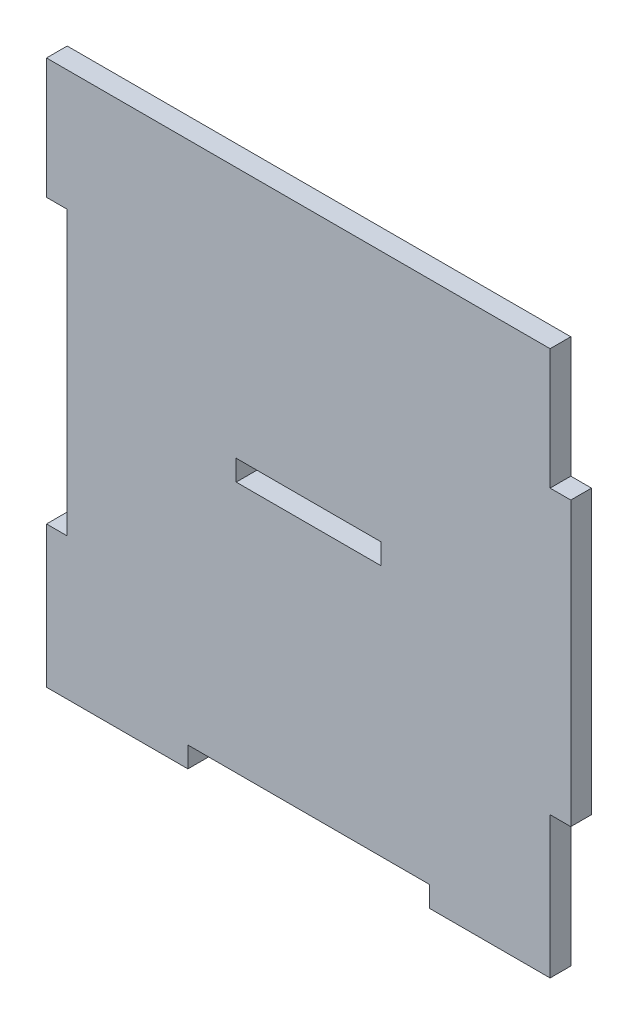
ISO-10303-21;
HEADER;
FILE_DESCRIPTION(('STEP AP214'),'2;1');
FILE_NAME('part.step','',(''),(''),'','','');
FILE_SCHEMA(('AUTOMOTIVE_DESIGN { 1 0 10303 214 1 1 1 1 }'));
ENDSEC;
DATA;
#1=APPLICATION_CONTEXT('core data for automotive mechanical design processes');
#2=APPLICATION_PROTOCOL_DEFINITION('international standard','automotive_design',2000,#1);
#3=PRODUCT_CONTEXT('',#1,'mechanical');
#4=PRODUCT('Part','Part','',(#3));
#5=PRODUCT_RELATED_PRODUCT_CATEGORY('part','',(#4));
#6=PRODUCT_DEFINITION_FORMATION('','',#4);
#7=PRODUCT_DEFINITION_CONTEXT('part definition',#1,'design');
#8=PRODUCT_DEFINITION('design','',#6,#7);
#9=PRODUCT_DEFINITION_SHAPE('','',#8);
#10=(LENGTH_UNIT() NAMED_UNIT(*) SI_UNIT(.MILLI.,.METRE.));
#11=(NAMED_UNIT(*) PLANE_ANGLE_UNIT() SI_UNIT($,.RADIAN.));
#12=(NAMED_UNIT(*) SI_UNIT($,.STERADIAN.) SOLID_ANGLE_UNIT());
#13=UNCERTAINTY_MEASURE_WITH_UNIT(LENGTH_MEASURE(1.E-05),#10,'distance_accuracy_value','');
#14=(GEOMETRIC_REPRESENTATION_CONTEXT(3) GLOBAL_UNCERTAINTY_ASSIGNED_CONTEXT((#13)) GLOBAL_UNIT_ASSIGNED_CONTEXT((#10,
#11,#12)) REPRESENTATION_CONTEXT('',''));
#15=CARTESIAN_POINT('',(0.,0.,0.));
#16=DIRECTION('',(0.,0.,1.));
#17=DIRECTION('',(1.,0.,0.));
#18=AXIS2_PLACEMENT_3D('',#15,#16,#17);
#19=CARTESIAN_POINT('',(35.,-20.5,3.));
#20=DIRECTION('',(0.,1.,0.));
#21=DIRECTION('',(-1.,0.,0.));
#22=AXIS2_PLACEMENT_3D('',#19,#20,#21);
#23=PLANE('',#22);
#24=DIRECTION('',(1.,0.,0.));
#25=VECTOR('',#24,1.);
#26=CARTESIAN_POINT('',(35.,-20.5,0.));
#27=LINE('',#26,#25);
#28=CARTESIAN_POINT('',(35.,-20.5,0.));
#29=VERTEX_POINT('',#28);
#30=CARTESIAN_POINT('',(38.,-20.5,0.));
#31=VERTEX_POINT('',#30);
#32=EDGE_CURVE('E218',#29,#31,#27,.T.);
#33=ORIENTED_EDGE('',*,*,#32,.T.);
#34=DIRECTION('',(0.,0.,-1.));
#35=VECTOR('',#34,1.);
#36=CARTESIAN_POINT('',(38.,-20.5,3.));
#37=LINE('',#36,#35);
#38=CARTESIAN_POINT('',(38.,-20.5,3.));
#39=VERTEX_POINT('',#38);
#40=EDGE_CURVE('E46',#39,#31,#37,.T.);
#41=ORIENTED_EDGE('',*,*,#40,.F.);
#42=DIRECTION('',(1.,0.,0.));
#43=VECTOR('',#42,1.);
#44=CARTESIAN_POINT('',(35.,-20.5,3.));
#45=LINE('',#44,#43);
#46=CARTESIAN_POINT('',(35.,-20.5,3.));
#47=VERTEX_POINT('',#46);
#48=EDGE_CURVE('E228',#47,#39,#45,.T.);
#49=ORIENTED_EDGE('',*,*,#48,.F.);
#50=DIRECTION('',(0.,0.,-1.));
#51=VECTOR('',#50,1.);
#52=CARTESIAN_POINT('',(35.,-20.5,3.));
#53=LINE('',#52,#51);
#54=EDGE_CURVE('E11',#47,#29,#53,.T.);
#55=ORIENTED_EDGE('',*,*,#54,.T.);
#56=EDGE_LOOP('',(#33,#41,#49,#55));
#57=FACE_BOUND('',#56,.T.);
#58=ADVANCED_FACE('F38',(#57),#23,.F.);
#59=CARTESIAN_POINT('',(38.,20.5,3.));
#60=DIRECTION('',(-1.,0.,0.));
#61=DIRECTION('',(0.,0.,1.));
#62=AXIS2_PLACEMENT_3D('',#59,#60,#61);
#63=PLANE('',#62);
#64=DIRECTION('',(0.,1.,0.));
#65=VECTOR('',#64,1.);
#66=CARTESIAN_POINT('',(38.,20.5,0.));
#67=LINE('',#66,#65);
#68=CARTESIAN_POINT('',(38.,20.5,0.));
#69=VERTEX_POINT('',#68);
#70=EDGE_CURVE('E278',#31,#69,#67,.T.);
#71=ORIENTED_EDGE('',*,*,#70,.T.);
#72=DIRECTION('',(0.,0.,-1.));
#73=VECTOR('',#72,1.);
#74=CARTESIAN_POINT('',(38.,20.5,3.));
#75=LINE('',#74,#73);
#76=CARTESIAN_POINT('',(38.,20.5,3.));
#77=VERTEX_POINT('',#76);
#78=EDGE_CURVE('E376',#77,#69,#75,.T.);
#79=ORIENTED_EDGE('',*,*,#78,.F.);
#80=DIRECTION('',(0.,1.,0.));
#81=VECTOR('',#80,1.);
#82=CARTESIAN_POINT('',(38.,20.5,3.));
#83=LINE('',#82,#81);
#84=EDGE_CURVE('E232',#39,#77,#83,.T.);
#85=ORIENTED_EDGE('',*,*,#84,.F.);
#86=ORIENTED_EDGE('',*,*,#40,.T.);
#87=EDGE_LOOP('',(#71,#79,#85,#86));
#88=FACE_BOUND('',#87,.T.);
#89=ADVANCED_FACE('F385',(#88),#63,.F.);
#90=CARTESIAN_POINT('',(35.,20.5,3.));
#91=DIRECTION('',(0.,-1.,0.));
#92=DIRECTION('',(1.,0.,0.));
#93=AXIS2_PLACEMENT_3D('',#90,#91,#92);
#94=PLANE('',#93);
#95=DIRECTION('',(-1.,0.,0.));
#96=VECTOR('',#95,1.);
#97=CARTESIAN_POINT('',(35.,20.5,0.));
#98=LINE('',#97,#96);
#99=CARTESIAN_POINT('',(35.,20.5,0.));
#100=VERTEX_POINT('',#99);
#101=EDGE_CURVE('E281',#69,#100,#98,.T.);
#102=ORIENTED_EDGE('',*,*,#101,.T.);
#103=DIRECTION('',(0.,0.,-1.));
#104=VECTOR('',#103,1.);
#105=CARTESIAN_POINT('',(35.,20.5,3.));
#106=LINE('',#105,#104);
#107=CARTESIAN_POINT('',(35.,20.5,3.));
#108=VERTEX_POINT('',#107);
#109=EDGE_CURVE('E372',#108,#100,#106,.T.);
#110=ORIENTED_EDGE('',*,*,#109,.F.);
#111=DIRECTION('',(-1.,0.,0.));
#112=VECTOR('',#111,1.);
#113=CARTESIAN_POINT('',(35.,20.5,3.));
#114=LINE('',#113,#112);
#115=EDGE_CURVE('E235',#77,#108,#114,.T.);
#116=ORIENTED_EDGE('',*,*,#115,.F.);
#117=ORIENTED_EDGE('',*,*,#78,.T.);
#118=EDGE_LOOP('',(#102,#110,#116,#117));
#119=FACE_BOUND('',#118,.T.);
#120=ADVANCED_FACE('F394',(#119),#94,.F.);
#121=CARTESIAN_POINT('',(35.,38.,3.));
#122=DIRECTION('',(-1.,0.,0.));
#123=DIRECTION('',(0.,-1.,0.));
#124=AXIS2_PLACEMENT_3D('',#121,#122,#123);
#125=PLANE('',#124);
#126=DIRECTION('',(0.,1.,0.));
#127=VECTOR('',#126,1.);
#128=CARTESIAN_POINT('',(35.,38.,0.));
#129=LINE('',#128,#127);
#130=CARTESIAN_POINT('',(35.,38.,0.));
#131=VERTEX_POINT('',#130);
#132=EDGE_CURVE('E284',#100,#131,#129,.T.);
#133=ORIENTED_EDGE('',*,*,#132,.T.);
#134=DIRECTION('',(0.,0.,-1.));
#135=VECTOR('',#134,1.);
#136=CARTESIAN_POINT('',(35.,38.,3.));
#137=LINE('',#136,#135);
#138=CARTESIAN_POINT('',(35.,38.,3.));
#139=VERTEX_POINT('',#138);
#140=EDGE_CURVE('E368',#139,#131,#137,.T.);
#141=ORIENTED_EDGE('',*,*,#140,.F.);
#142=DIRECTION('',(0.,1.,0.));
#143=VECTOR('',#142,1.);
#144=CARTESIAN_POINT('',(35.,38.,3.));
#145=LINE('',#144,#143);
#146=EDGE_CURVE('E238',#108,#139,#145,.T.);
#147=ORIENTED_EDGE('',*,*,#146,.F.);
#148=ORIENTED_EDGE('',*,*,#109,.T.);
#149=EDGE_LOOP('',(#133,#141,#147,#148));
#150=FACE_BOUND('',#149,.T.);
#151=ADVANCED_FACE('F398',(#150),#125,.F.);
#152=CARTESIAN_POINT('',(-38.,38.,3.));
#153=DIRECTION('',(0.,-1.,0.));
#154=DIRECTION('',(0.,0.,-1.));
#155=AXIS2_PLACEMENT_3D('',#152,#153,#154);
#156=PLANE('',#155);
#157=DIRECTION('',(-1.,0.,0.));
#158=VECTOR('',#157,1.);
#159=CARTESIAN_POINT('',(-38.,38.,0.));
#160=LINE('',#159,#158);
#161=CARTESIAN_POINT('',(-38.,38.,0.));
#162=VERTEX_POINT('',#161);
#163=EDGE_CURVE('E288',#131,#162,#160,.T.);
#164=ORIENTED_EDGE('',*,*,#163,.T.);
#165=DIRECTION('',(0.,0.,-1.));
#166=VECTOR('',#165,1.);
#167=CARTESIAN_POINT('',(-38.,38.,3.));
#168=LINE('',#167,#166);
#169=CARTESIAN_POINT('',(-38.,38.,3.));
#170=VERTEX_POINT('',#169);
#171=EDGE_CURVE('E364',#170,#162,#168,.T.);
#172=ORIENTED_EDGE('',*,*,#171,.F.);
#173=DIRECTION('',(-1.,0.,0.));
#174=VECTOR('',#173,1.);
#175=CARTESIAN_POINT('',(17.5,38.,3.));
#176=LINE('',#175,#174);
#177=EDGE_CURVE('E241',#139,#170,#176,.T.);
#178=ORIENTED_EDGE('',*,*,#177,.F.);
#179=ORIENTED_EDGE('',*,*,#140,.T.);
#180=EDGE_LOOP('',(#164,#172,#178,#179));
#181=FACE_BOUND('',#180,.T.);
#182=ADVANCED_FACE('F456',(#181),#156,.F.);
#183=CARTESIAN_POINT('',(-38.,20.5,3.));
#184=DIRECTION('',(1.,0.,0.));
#185=DIRECTION('',(0.,0.,-1.));
#186=AXIS2_PLACEMENT_3D('',#183,#184,#185);
#187=PLANE('',#186);
#188=DIRECTION('',(0.,-1.,0.));
#189=VECTOR('',#188,1.);
#190=CARTESIAN_POINT('',(-38.,20.5,0.));
#191=LINE('',#190,#189);
#192=CARTESIAN_POINT('',(-38.,20.5,0.));
#193=VERTEX_POINT('',#192);
#194=EDGE_CURVE('E291',#162,#193,#191,.T.);
#195=ORIENTED_EDGE('',*,*,#194,.T.);
#196=DIRECTION('',(0.,0.,-1.));
#197=VECTOR('',#196,1.);
#198=CARTESIAN_POINT('',(-38.,20.5,3.));
#199=LINE('',#198,#197);
#200=CARTESIAN_POINT('',(-38.,20.5,3.));
#201=VERTEX_POINT('',#200);
#202=EDGE_CURVE('E360',#201,#193,#199,.T.);
#203=ORIENTED_EDGE('',*,*,#202,.F.);
#204=DIRECTION('',(0.,-1.,0.));
#205=VECTOR('',#204,1.);
#206=CARTESIAN_POINT('',(-38.,20.5,3.));
#207=LINE('',#206,#205);
#208=EDGE_CURVE('E244',#170,#201,#207,.T.);
#209=ORIENTED_EDGE('',*,*,#208,.F.);
#210=ORIENTED_EDGE('',*,*,#171,.T.);
#211=EDGE_LOOP('',(#195,#203,#209,#210));
#212=FACE_BOUND('',#211,.T.);
#213=ADVANCED_FACE('F454',(#212),#187,.F.);
#214=CARTESIAN_POINT('',(-35.,20.5,3.));
#215=DIRECTION('',(0.,1.,0.));
#216=DIRECTION('',(0.,0.,1.));
#217=AXIS2_PLACEMENT_3D('',#214,#215,#216);
#218=PLANE('',#217);
#219=DIRECTION('',(1.,0.,0.));
#220=VECTOR('',#219,1.);
#221=CARTESIAN_POINT('',(-35.,20.5,0.));
#222=LINE('',#221,#220);
#223=CARTESIAN_POINT('',(-35.,20.5,0.));
#224=VERTEX_POINT('',#223);
#225=EDGE_CURVE('E294',#193,#224,#222,.T.);
#226=ORIENTED_EDGE('',*,*,#225,.T.);
#227=DIRECTION('',(0.,0.,-1.));
#228=VECTOR('',#227,1.);
#229=CARTESIAN_POINT('',(-35.,20.5,3.));
#230=LINE('',#229,#228);
#231=CARTESIAN_POINT('',(-35.,20.5,3.));
#232=VERTEX_POINT('',#231);
#233=EDGE_CURVE('E356',#232,#224,#230,.T.);
#234=ORIENTED_EDGE('',*,*,#233,.F.);
#235=DIRECTION('',(1.,0.,0.));
#236=VECTOR('',#235,1.);
#237=CARTESIAN_POINT('',(-35.,20.5,3.));
#238=LINE('',#237,#236);
#239=EDGE_CURVE('E247',#201,#232,#238,.T.);
#240=ORIENTED_EDGE('',*,*,#239,.F.);
#241=ORIENTED_EDGE('',*,*,#202,.T.);
#242=EDGE_LOOP('',(#226,#234,#240,#241));
#243=FACE_BOUND('',#242,.T.);
#244=ADVANCED_FACE('F449',(#243),#218,.F.);
#245=CARTESIAN_POINT('',(-35.,20.5,3.));
#246=DIRECTION('',(1.,0.,0.));
#247=DIRECTION('',(0.,0.,-1.));
#248=AXIS2_PLACEMENT_3D('',#245,#246,#247);
#249=PLANE('',#248);
#250=DIRECTION('',(0.,-1.,0.));
#251=VECTOR('',#250,1.);
#252=CARTESIAN_POINT('',(-35.,20.5,0.));
#253=LINE('',#252,#251);
#254=CARTESIAN_POINT('',(-35.,-20.5,0.));
#255=VERTEX_POINT('',#254);
#256=EDGE_CURVE('E297',#224,#255,#253,.T.);
#257=ORIENTED_EDGE('',*,*,#256,.T.);
#258=DIRECTION('',(0.,0.,-1.));
#259=VECTOR('',#258,1.);
#260=CARTESIAN_POINT('',(-35.,-20.5,3.));
#261=LINE('',#260,#259);
#262=CARTESIAN_POINT('',(-35.,-20.5,3.));
#263=VERTEX_POINT('',#262);
#264=EDGE_CURVE('E352',#263,#255,#261,.T.);
#265=ORIENTED_EDGE('',*,*,#264,.F.);
#266=DIRECTION('',(0.,-1.,0.));
#267=VECTOR('',#266,1.);
#268=CARTESIAN_POINT('',(-35.,20.5,3.));
#269=LINE('',#268,#267);
#270=EDGE_CURVE('E250',#232,#263,#269,.T.);
#271=ORIENTED_EDGE('',*,*,#270,.F.);
#272=ORIENTED_EDGE('',*,*,#233,.T.);
#273=EDGE_LOOP('',(#257,#265,#271,#272));
#274=FACE_BOUND('',#273,.T.);
#275=ADVANCED_FACE('F444',(#274),#249,.F.);
#276=CARTESIAN_POINT('',(-35.,-20.5,3.));
#277=DIRECTION('',(0.,-1.,0.));
#278=DIRECTION('',(0.,0.,-1.));
#279=AXIS2_PLACEMENT_3D('',#276,#277,#278);
#280=PLANE('',#279);
#281=DIRECTION('',(-1.,0.,0.));
#282=VECTOR('',#281,1.);
#283=CARTESIAN_POINT('',(-35.,-20.5,0.));
#284=LINE('',#283,#282);
#285=CARTESIAN_POINT('',(-38.,-20.5,0.));
#286=VERTEX_POINT('',#285);
#287=EDGE_CURVE('E300',#255,#286,#284,.T.);
#288=ORIENTED_EDGE('',*,*,#287,.T.);
#289=DIRECTION('',(0.,0.,-1.));
#290=VECTOR('',#289,1.);
#291=CARTESIAN_POINT('',(-38.,-20.5,3.));
#292=LINE('',#291,#290);
#293=CARTESIAN_POINT('',(-38.,-20.5,3.));
#294=VERTEX_POINT('',#293);
#295=EDGE_CURVE('E348',#294,#286,#292,.T.);
#296=ORIENTED_EDGE('',*,*,#295,.F.);
#297=DIRECTION('',(-1.,0.,0.));
#298=VECTOR('',#297,1.);
#299=CARTESIAN_POINT('',(-35.,-20.5,3.));
#300=LINE('',#299,#298);
#301=EDGE_CURVE('E253',#263,#294,#300,.T.);
#302=ORIENTED_EDGE('',*,*,#301,.F.);
#303=ORIENTED_EDGE('',*,*,#264,.T.);
#304=EDGE_LOOP('',(#288,#296,#302,#303));
#305=FACE_BOUND('',#304,.T.);
#306=ADVANCED_FACE('F439',(#305),#280,.F.);
#307=CARTESIAN_POINT('',(-38.,-38.,3.));
#308=DIRECTION('',(1.,0.,0.));
#309=DIRECTION('',(0.,0.,-1.));
#310=AXIS2_PLACEMENT_3D('',#307,#308,#309);
#311=PLANE('',#310);
#312=DIRECTION('',(0.,-1.,0.));
#313=VECTOR('',#312,1.);
#314=CARTESIAN_POINT('',(-38.,-38.,0.));
#315=LINE('',#314,#313);
#316=CARTESIAN_POINT('',(-38.,-41.,0.));
#317=VERTEX_POINT('',#316);
#318=EDGE_CURVE('E304',#286,#317,#315,.T.);
#319=ORIENTED_EDGE('',*,*,#318,.T.);
#320=DIRECTION('',(0.,0.,-1.));
#321=VECTOR('',#320,1.);
#322=CARTESIAN_POINT('',(-38.,-41.,3.));
#323=LINE('',#322,#321);
#324=CARTESIAN_POINT('',(-38.,-41.,3.));
#325=VERTEX_POINT('',#324);
#326=EDGE_CURVE('E344',#325,#317,#323,.T.);
#327=ORIENTED_EDGE('',*,*,#326,.F.);
#328=DIRECTION('',(0.,-1.,0.));
#329=VECTOR('',#328,1.);
#330=CARTESIAN_POINT('',(-38.,-20.5,3.));
#331=LINE('',#330,#329);
#332=EDGE_CURVE('E256',#294,#325,#331,.T.);
#333=ORIENTED_EDGE('',*,*,#332,.F.);
#334=ORIENTED_EDGE('',*,*,#295,.T.);
#335=EDGE_LOOP('',(#319,#327,#333,#334));
#336=FACE_BOUND('',#335,.T.);
#337=ADVANCED_FACE('F434',(#336),#311,.F.);
#338=CARTESIAN_POINT('',(-35.,-41.,3.));
#339=DIRECTION('',(0.,1.,0.));
#340=DIRECTION('',(0.,0.,1.));
#341=AXIS2_PLACEMENT_3D('',#338,#339,#340);
#342=PLANE('',#341);
#343=DIRECTION('',(1.,0.,0.));
#344=VECTOR('',#343,1.);
#345=CARTESIAN_POINT('',(-35.,-41.,0.));
#346=LINE('',#345,#344);
#347=CARTESIAN_POINT('',(-17.5,-41.,0.));
#348=VERTEX_POINT('',#347);
#349=EDGE_CURVE('E308',#317,#348,#346,.T.);
#350=ORIENTED_EDGE('',*,*,#349,.T.);
#351=DIRECTION('',(0.,0.,-1.));
#352=VECTOR('',#351,1.);
#353=CARTESIAN_POINT('',(-17.5,-41.,3.));
#354=LINE('',#353,#352);
#355=CARTESIAN_POINT('',(-17.5,-41.,3.));
#356=VERTEX_POINT('',#355);
#357=EDGE_CURVE('E340',#356,#348,#354,.T.);
#358=ORIENTED_EDGE('',*,*,#357,.F.);
#359=DIRECTION('',(1.,0.,0.));
#360=VECTOR('',#359,1.);
#361=CARTESIAN_POINT('',(-38.,-41.,3.));
#362=LINE('',#361,#360);
#363=EDGE_CURVE('E259',#325,#356,#362,.T.);
#364=ORIENTED_EDGE('',*,*,#363,.F.);
#365=ORIENTED_EDGE('',*,*,#326,.T.);
#366=EDGE_LOOP('',(#350,#358,#364,#365));
#367=FACE_BOUND('',#366,.T.);
#368=ADVANCED_FACE('F430',(#367),#342,.F.);
#369=CARTESIAN_POINT('',(-17.5,-38.,3.));
#370=DIRECTION('',(-1.,0.,0.));
#371=DIRECTION('',(0.,0.,1.));
#372=AXIS2_PLACEMENT_3D('',#369,#370,#371);
#373=PLANE('',#372);
#374=DIRECTION('',(0.,1.,0.));
#375=VECTOR('',#374,1.);
#376=CARTESIAN_POINT('',(-17.5,-38.,0.));
#377=LINE('',#376,#375);
#378=CARTESIAN_POINT('',(-17.5,-38.,0.));
#379=VERTEX_POINT('',#378);
#380=EDGE_CURVE('E311',#348,#379,#377,.T.);
#381=ORIENTED_EDGE('',*,*,#380,.T.);
#382=DIRECTION('',(0.,0.,-1.));
#383=VECTOR('',#382,1.);
#384=CARTESIAN_POINT('',(-17.5,-38.,3.));
#385=LINE('',#384,#383);
#386=CARTESIAN_POINT('',(-17.5,-38.,3.));
#387=VERTEX_POINT('',#386);
#388=EDGE_CURVE('E336',#387,#379,#385,.T.);
#389=ORIENTED_EDGE('',*,*,#388,.F.);
#390=DIRECTION('',(0.,1.,0.));
#391=VECTOR('',#390,1.);
#392=CARTESIAN_POINT('',(-17.5,-38.,3.));
#393=LINE('',#392,#391);
#394=EDGE_CURVE('E262',#356,#387,#393,.T.);
#395=ORIENTED_EDGE('',*,*,#394,.F.);
#396=ORIENTED_EDGE('',*,*,#357,.T.);
#397=EDGE_LOOP('',(#381,#389,#395,#396));
#398=FACE_BOUND('',#397,.T.);
#399=ADVANCED_FACE('F425',(#398),#373,.F.);
#400=CARTESIAN_POINT('',(-17.5,-38.,3.));
#401=DIRECTION('',(0.,1.,0.));
#402=DIRECTION('',(-1.,0.,0.));
#403=AXIS2_PLACEMENT_3D('',#400,#401,#402);
#404=PLANE('',#403);
#405=DIRECTION('',(1.,0.,0.));
#406=VECTOR('',#405,1.);
#407=CARTESIAN_POINT('',(-17.5,-38.,0.));
#408=LINE('',#407,#406);
#409=CARTESIAN_POINT('',(17.5,-38.,0.));
#410=VERTEX_POINT('',#409);
#411=EDGE_CURVE('E314',#379,#410,#408,.T.);
#412=ORIENTED_EDGE('',*,*,#411,.T.);
#413=DIRECTION('',(0.,0.,-1.));
#414=VECTOR('',#413,1.);
#415=CARTESIAN_POINT('',(17.5,-38.,3.));
#416=LINE('',#415,#414);
#417=CARTESIAN_POINT('',(17.5,-38.,3.));
#418=VERTEX_POINT('',#417);
#419=EDGE_CURVE('E332',#418,#410,#416,.T.);
#420=ORIENTED_EDGE('',*,*,#419,.F.);
#421=DIRECTION('',(1.,0.,0.));
#422=VECTOR('',#421,1.);
#423=CARTESIAN_POINT('',(-17.5,-38.,3.));
#424=LINE('',#423,#422);
#425=EDGE_CURVE('E265',#387,#418,#424,.T.);
#426=ORIENTED_EDGE('',*,*,#425,.F.);
#427=ORIENTED_EDGE('',*,*,#388,.T.);
#428=EDGE_LOOP('',(#412,#420,#426,#427));
#429=FACE_BOUND('',#428,.T.);
#430=ADVANCED_FACE('F421',(#429),#404,.F.);
#431=CARTESIAN_POINT('',(17.5,-41.,3.));
#432=DIRECTION('',(1.,0.,0.));
#433=DIRECTION('',(0.,1.,0.));
#434=AXIS2_PLACEMENT_3D('',#431,#432,#433);
#435=PLANE('',#434);
#436=DIRECTION('',(0.,-1.,0.));
#437=VECTOR('',#436,1.);
#438=CARTESIAN_POINT('',(17.5,-41.,0.));
#439=LINE('',#438,#437);
#440=CARTESIAN_POINT('',(17.5,-41.,0.));
#441=VERTEX_POINT('',#440);
#442=EDGE_CURVE('E317',#410,#441,#439,.T.);
#443=ORIENTED_EDGE('',*,*,#442,.T.);
#444=DIRECTION('',(0.,0.,-1.));
#445=VECTOR('',#444,1.);
#446=CARTESIAN_POINT('',(17.5,-41.,3.));
#447=LINE('',#446,#445);
#448=CARTESIAN_POINT('',(17.5,-41.,3.));
#449=VERTEX_POINT('',#448);
#450=EDGE_CURVE('E328',#449,#441,#447,.T.);
#451=ORIENTED_EDGE('',*,*,#450,.F.);
#452=DIRECTION('',(0.,-1.,0.));
#453=VECTOR('',#452,1.);
#454=CARTESIAN_POINT('',(17.5,-41.,3.));
#455=LINE('',#454,#453);
#456=EDGE_CURVE('E268',#418,#449,#455,.T.);
#457=ORIENTED_EDGE('',*,*,#456,.F.);
#458=ORIENTED_EDGE('',*,*,#419,.T.);
#459=EDGE_LOOP('',(#443,#451,#457,#458));
#460=FACE_BOUND('',#459,.T.);
#461=ADVANCED_FACE('F417',(#460),#435,.F.);
#462=CARTESIAN_POINT('',(35.,-41.,3.));
#463=DIRECTION('',(0.,1.,0.));
#464=DIRECTION('',(-1.,0.,0.));
#465=AXIS2_PLACEMENT_3D('',#462,#463,#464);
#466=PLANE('',#465);
#467=DIRECTION('',(1.,0.,0.));
#468=VECTOR('',#467,1.);
#469=CARTESIAN_POINT('',(35.,-41.,0.));
#470=LINE('',#469,#468);
#471=CARTESIAN_POINT('',(35.,-41.,0.));
#472=VERTEX_POINT('',#471);
#473=EDGE_CURVE('E320',#441,#472,#470,.T.);
#474=ORIENTED_EDGE('',*,*,#473,.T.);
#475=DIRECTION('',(0.,0.,-1.));
#476=VECTOR('',#475,1.);
#477=CARTESIAN_POINT('',(35.,-41.,3.));
#478=LINE('',#477,#476);
#479=CARTESIAN_POINT('',(35.,-41.,3.));
#480=VERTEX_POINT('',#479);
#481=EDGE_CURVE('E275',#480,#472,#478,.T.);
#482=ORIENTED_EDGE('',*,*,#481,.F.);
#483=DIRECTION('',(1.,0.,0.));
#484=VECTOR('',#483,1.);
#485=CARTESIAN_POINT('',(35.,-41.,3.));
#486=LINE('',#485,#484);
#487=EDGE_CURVE('E271',#449,#480,#486,.T.);
#488=ORIENTED_EDGE('',*,*,#487,.F.);
#489=ORIENTED_EDGE('',*,*,#450,.T.);
#490=EDGE_LOOP('',(#474,#482,#488,#489));
#491=FACE_BOUND('',#490,.T.);
#492=ADVANCED_FACE('F412',(#491),#466,.F.);
#493=CARTESIAN_POINT('',(35.,-38.,3.));
#494=DIRECTION('',(-1.,0.,0.));
#495=DIRECTION('',(0.,-1.,0.));
#496=AXIS2_PLACEMENT_3D('',#493,#494,#495);
#497=PLANE('',#496);
#498=DIRECTION('',(0.,1.,0.));
#499=VECTOR('',#498,1.);
#500=CARTESIAN_POINT('',(35.,-38.,0.));
#501=LINE('',#500,#499);
#502=EDGE_CURVE('E229',#472,#29,#501,.T.);
#503=ORIENTED_EDGE('',*,*,#502,.T.);
#504=ORIENTED_EDGE('',*,*,#54,.F.);
#505=DIRECTION('',(0.,1.,0.));
#506=VECTOR('',#505,1.);
#507=CARTESIAN_POINT('',(35.,-20.5,3.));
#508=LINE('',#507,#506);
#509=EDGE_CURVE('E224',#480,#47,#508,.T.);
#510=ORIENTED_EDGE('',*,*,#509,.F.);
#511=ORIENTED_EDGE('',*,*,#481,.T.);
#512=EDGE_LOOP('',(#503,#504,#510,#511));
#513=FACE_BOUND('',#512,.T.);
#514=ADVANCED_FACE('F406',(#513),#497,.F.);
#515=CARTESIAN_POINT('',(0.,0.,3.));
#516=DIRECTION('',(0.,0.,-1.));
#517=DIRECTION('',(-1.,0.,0.));
#518=AXIS2_PLACEMENT_3D('',#515,#516,#517);
#519=PLANE('',#518);
#520=DIRECTION('',(-1.,0.,0.));
#521=VECTOR('',#520,1.);
#522=CARTESIAN_POINT('',(-10.5,1.5,3.));
#523=LINE('',#522,#521);
#524=CARTESIAN_POINT('',(10.5,1.5,3.));
#525=VERTEX_POINT('',#524);
#526=CARTESIAN_POINT('',(-10.5,1.5,3.));
#527=VERTEX_POINT('',#526);
#528=EDGE_CURVE('E209',#525,#527,#523,.T.);
#529=ORIENTED_EDGE('',*,*,#528,.F.);
#530=DIRECTION('',(0.,1.,0.));
#531=VECTOR('',#530,1.);
#532=CARTESIAN_POINT('',(10.5,-1.5,3.));
#533=LINE('',#532,#531);
#534=CARTESIAN_POINT('',(10.5,-1.5,3.));
#535=VERTEX_POINT('',#534);
#536=EDGE_CURVE('E53',#535,#525,#533,.T.);
#537=ORIENTED_EDGE('',*,*,#536,.F.);
#538=DIRECTION('',(1.,0.,0.));
#539=VECTOR('',#538,1.);
#540=CARTESIAN_POINT('',(-10.5,-1.5,3.));
#541=LINE('',#540,#539);
#542=CARTESIAN_POINT('',(-10.5,-1.5,3.));
#543=VERTEX_POINT('',#542);
#544=EDGE_CURVE('E196',#543,#535,#541,.T.);
#545=ORIENTED_EDGE('',*,*,#544,.F.);
#546=DIRECTION('',(0.,-1.,0.));
#547=VECTOR('',#546,1.);
#548=CARTESIAN_POINT('',(-10.5,-1.5,3.));
#549=LINE('',#548,#547);
#550=EDGE_CURVE('E200',#527,#543,#549,.T.);
#551=ORIENTED_EDGE('',*,*,#550,.F.);
#552=EDGE_LOOP('',(#529,#537,#545,#551));
#553=FACE_BOUND('',#552,.T.);
#554=ORIENTED_EDGE('',*,*,#509,.T.);
#555=ORIENTED_EDGE('',*,*,#48,.T.);
#556=ORIENTED_EDGE('',*,*,#84,.T.);
#557=ORIENTED_EDGE('',*,*,#115,.T.);
#558=ORIENTED_EDGE('',*,*,#146,.T.);
#559=ORIENTED_EDGE('',*,*,#177,.T.);
#560=ORIENTED_EDGE('',*,*,#208,.T.);
#561=ORIENTED_EDGE('',*,*,#239,.T.);
#562=ORIENTED_EDGE('',*,*,#270,.T.);
#563=ORIENTED_EDGE('',*,*,#301,.T.);
#564=ORIENTED_EDGE('',*,*,#332,.T.);
#565=ORIENTED_EDGE('',*,*,#363,.T.);
#566=ORIENTED_EDGE('',*,*,#394,.T.);
#567=ORIENTED_EDGE('',*,*,#425,.T.);
#568=ORIENTED_EDGE('',*,*,#456,.T.);
#569=ORIENTED_EDGE('',*,*,#487,.T.);
#570=EDGE_LOOP('',(#554,#555,#556,#557,#558,#559,#560,#561,#562,#563,#564,#565,#566,#567,#568,#569));
#571=FACE_BOUND('',#570,.T.);
#572=ADVANCED_FACE('F402',(#553,#571),#519,.F.);
#573=CARTESIAN_POINT('',(0.,0.,0.));
#574=DIRECTION('',(0.,0.,-1.));
#575=DIRECTION('',(-1.,0.,0.));
#576=AXIS2_PLACEMENT_3D('',#573,#574,#575);
#577=PLANE('',#576);
#578=DIRECTION('',(0.,1.,0.));
#579=VECTOR('',#578,1.);
#580=CARTESIAN_POINT('',(10.5,-1.5,0.));
#581=LINE('',#580,#579);
#582=CARTESIAN_POINT('',(10.5,-1.5,0.));
#583=VERTEX_POINT('',#582);
#584=CARTESIAN_POINT('',(10.5,1.5,0.));
#585=VERTEX_POINT('',#584);
#586=EDGE_CURVE('E177',#583,#585,#581,.T.);
#587=ORIENTED_EDGE('',*,*,#586,.T.);
#588=DIRECTION('',(-1.,0.,0.));
#589=VECTOR('',#588,1.);
#590=CARTESIAN_POINT('',(-10.5,1.5,0.));
#591=LINE('',#590,#589);
#592=CARTESIAN_POINT('',(-10.5,1.5,0.));
#593=VERTEX_POINT('',#592);
#594=EDGE_CURVE('E187',#585,#593,#591,.T.);
#595=ORIENTED_EDGE('',*,*,#594,.T.);
#596=DIRECTION('',(0.,-1.,0.));
#597=VECTOR('',#596,1.);
#598=CARTESIAN_POINT('',(-10.5,-1.5,0.));
#599=LINE('',#598,#597);
#600=CARTESIAN_POINT('',(-10.5,-1.5,0.));
#601=VERTEX_POINT('',#600);
#602=EDGE_CURVE('E61',#593,#601,#599,.T.);
#603=ORIENTED_EDGE('',*,*,#602,.T.);
#604=DIRECTION('',(1.,0.,0.));
#605=VECTOR('',#604,1.);
#606=CARTESIAN_POINT('',(-10.5,-1.5,0.));
#607=LINE('',#606,#605);
#608=EDGE_CURVE('E184',#601,#583,#607,.T.);
#609=ORIENTED_EDGE('',*,*,#608,.T.);
#610=EDGE_LOOP('',(#587,#595,#603,#609));
#611=FACE_BOUND('',#610,.T.);
#612=ORIENTED_EDGE('',*,*,#32,.F.);
#613=ORIENTED_EDGE('',*,*,#502,.F.);
#614=ORIENTED_EDGE('',*,*,#473,.F.);
#615=ORIENTED_EDGE('',*,*,#442,.F.);
#616=ORIENTED_EDGE('',*,*,#411,.F.);
#617=ORIENTED_EDGE('',*,*,#380,.F.);
#618=ORIENTED_EDGE('',*,*,#349,.F.);
#619=ORIENTED_EDGE('',*,*,#318,.F.);
#620=ORIENTED_EDGE('',*,*,#287,.F.);
#621=ORIENTED_EDGE('',*,*,#256,.F.);
#622=ORIENTED_EDGE('',*,*,#225,.F.);
#623=ORIENTED_EDGE('',*,*,#194,.F.);
#624=ORIENTED_EDGE('',*,*,#163,.F.);
#625=ORIENTED_EDGE('',*,*,#132,.F.);
#626=ORIENTED_EDGE('',*,*,#101,.F.);
#627=ORIENTED_EDGE('',*,*,#70,.F.);
#628=EDGE_LOOP('',(#612,#613,#614,#615,#616,#617,#618,#619,#620,#621,#622,#623,#624,#625,#626,#627));
#629=FACE_BOUND('',#628,.T.);
#630=ADVANCED_FACE('F192',(#611,#629),#577,.T.);
#631=CARTESIAN_POINT('',(10.5,-1.5,0.));
#632=DIRECTION('',(1.,0.,0.));
#633=DIRECTION('',(0.,0.,-1.));
#634=AXIS2_PLACEMENT_3D('',#631,#632,#633);
#635=PLANE('',#634);
#636=ORIENTED_EDGE('',*,*,#536,.T.);
#637=DIRECTION('',(0.,0.,1.));
#638=VECTOR('',#637,1.);
#639=CARTESIAN_POINT('',(10.5,1.5,0.));
#640=LINE('',#639,#638);
#641=EDGE_CURVE('E173',#585,#525,#640,.T.);
#642=ORIENTED_EDGE('',*,*,#641,.F.);
#643=ORIENTED_EDGE('',*,*,#586,.F.);
#644=DIRECTION('',(0.,0.,1.));
#645=VECTOR('',#644,1.);
#646=CARTESIAN_POINT('',(10.5,-1.5,0.));
#647=LINE('',#646,#645);
#648=EDGE_CURVE('E215',#583,#535,#647,.T.);
#649=ORIENTED_EDGE('',*,*,#648,.T.);
#650=EDGE_LOOP('',(#636,#642,#643,#649));
#651=FACE_BOUND('',#650,.T.);
#652=ADVANCED_FACE('F175',(#651),#635,.F.);
#653=CARTESIAN_POINT('',(-10.5,-1.5,0.));
#654=DIRECTION('',(0.,-1.,0.));
#655=DIRECTION('',(0.,0.,-1.));
#656=AXIS2_PLACEMENT_3D('',#653,#654,#655);
#657=PLANE('',#656);
#658=ORIENTED_EDGE('',*,*,#544,.T.);
#659=ORIENTED_EDGE('',*,*,#648,.F.);
#660=ORIENTED_EDGE('',*,*,#608,.F.);
#661=DIRECTION('',(0.,0.,1.));
#662=VECTOR('',#661,1.);
#663=CARTESIAN_POINT('',(-10.5,-1.5,0.));
#664=LINE('',#663,#662);
#665=EDGE_CURVE('E219',#601,#543,#664,.T.);
#666=ORIENTED_EDGE('',*,*,#665,.T.);
#667=EDGE_LOOP('',(#658,#659,#660,#666));
#668=FACE_BOUND('',#667,.T.);
#669=ADVANCED_FACE('F596',(#668),#657,.F.);
#670=CARTESIAN_POINT('',(-10.5,-1.5,0.));
#671=DIRECTION('',(-1.,0.,0.));
#672=DIRECTION('',(0.,0.,1.));
#673=AXIS2_PLACEMENT_3D('',#670,#671,#672);
#674=PLANE('',#673);
#675=ORIENTED_EDGE('',*,*,#550,.T.);
#676=ORIENTED_EDGE('',*,*,#665,.F.);
#677=ORIENTED_EDGE('',*,*,#602,.F.);
#678=DIRECTION('',(0.,0.,1.));
#679=VECTOR('',#678,1.);
#680=CARTESIAN_POINT('',(-10.5,1.5,0.));
#681=LINE('',#680,#679);
#682=EDGE_CURVE('E183',#593,#527,#681,.T.);
#683=ORIENTED_EDGE('',*,*,#682,.T.);
#684=EDGE_LOOP('',(#675,#676,#677,#683));
#685=FACE_BOUND('',#684,.T.);
#686=ADVANCED_FACE('F605',(#685),#674,.F.);
#687=CARTESIAN_POINT('',(-10.5,1.5,0.));
#688=DIRECTION('',(0.,1.,0.));
#689=DIRECTION('',(0.,0.,1.));
#690=AXIS2_PLACEMENT_3D('',#687,#688,#689);
#691=PLANE('',#690);
#692=ORIENTED_EDGE('',*,*,#528,.T.);
#693=ORIENTED_EDGE('',*,*,#682,.F.);
#694=ORIENTED_EDGE('',*,*,#594,.F.);
#695=ORIENTED_EDGE('',*,*,#641,.T.);
#696=EDGE_LOOP('',(#692,#693,#694,#695));
#697=FACE_BOUND('',#696,.T.);
#698=ADVANCED_FACE('F188',(#697),#691,.F.);
#699=CLOSED_SHELL('',(#58,#89,#120,#151,#182,#213,#244,#275,#306,#337,#368,#399,#430,#461,#492,
#514,#572,#630,#652,#669,#686,#698));
#700=MANIFOLD_SOLID_BREP('B2',#699);
#701=ADVANCED_BREP_SHAPE_REPRESENTATION('',(#18,#700),#14);
#702=SHAPE_DEFINITION_REPRESENTATION(#9,#701);
ENDSEC;
END-ISO-10303-21;
